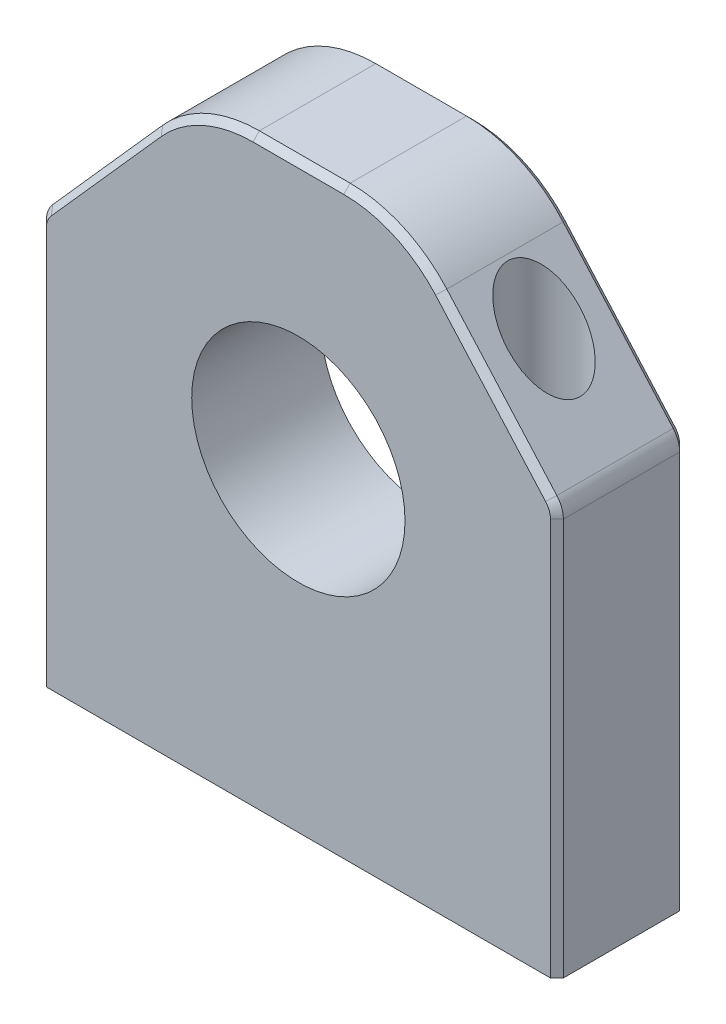
ISO-10303-21;
HEADER;
FILE_DESCRIPTION(('STEP AP214'),'2;1');
FILE_NAME('part.step','',(''),(''),'','','');
FILE_SCHEMA(('AUTOMOTIVE_DESIGN { 1 0 10303 214 1 1 1 1 }'));
ENDSEC;
DATA;
#1=APPLICATION_CONTEXT('core data for automotive mechanical design processes');
#2=APPLICATION_PROTOCOL_DEFINITION('international standard','automotive_design',2000,#1);
#3=PRODUCT_CONTEXT('',#1,'mechanical');
#4=PRODUCT('Part','Part','',(#3));
#5=PRODUCT_RELATED_PRODUCT_CATEGORY('part','',(#4));
#6=PRODUCT_DEFINITION_FORMATION('','',#4);
#7=PRODUCT_DEFINITION_CONTEXT('part definition',#1,'design');
#8=PRODUCT_DEFINITION('design','',#6,#7);
#9=PRODUCT_DEFINITION_SHAPE('','',#8);
#10=(LENGTH_UNIT() NAMED_UNIT(*) SI_UNIT(.MILLI.,.METRE.));
#11=(NAMED_UNIT(*) PLANE_ANGLE_UNIT() SI_UNIT($,.RADIAN.));
#12=(NAMED_UNIT(*) SI_UNIT($,.STERADIAN.) SOLID_ANGLE_UNIT());
#13=UNCERTAINTY_MEASURE_WITH_UNIT(LENGTH_MEASURE(1.E-05),#10,'distance_accuracy_value','');
#14=(GEOMETRIC_REPRESENTATION_CONTEXT(3) GLOBAL_UNCERTAINTY_ASSIGNED_CONTEXT((#13)) GLOBAL_UNIT_ASSIGNED_CONTEXT((#10,
#11,#12)) REPRESENTATION_CONTEXT('',''));
#15=CARTESIAN_POINT('',(0.,0.,0.));
#16=DIRECTION('',(0.,0.,1.));
#17=DIRECTION('',(1.,0.,0.));
#18=AXIS2_PLACEMENT_3D('',#15,#16,#17);
#19=CARTESIAN_POINT('',(14.,45.,5.));
#20=DIRECTION('',(0.,1.,0.));
#21=DIRECTION('',(0.,0.,1.));
#22=AXIS2_PLACEMENT_3D('',#19,#20,#21);
#23=CYLINDRICAL_SURFACE('',#22,1.69999999999999);
#24=CARTESIAN_POINT('',(14.,0.,5.));
#25=DIRECTION('',(0.,1.,0.));
#26=DIRECTION('',(0.,0.,1.));
#27=AXIS2_PLACEMENT_3D('',#24,#25,#26);
#28=CIRCLE('',#27,1.69999999999999);
#29=CARTESIAN_POINT('',(14.,0.,6.69999999999999));
#30=VERTEX_POINT('',#29);
#31=EDGE_CURVE('E220',#30,#30,#28,.F.);
#32=ORIENTED_EDGE('',*,*,#31,.T.);
#33=EDGE_LOOP('',(#32));
#34=FACE_BOUND('',#33,.T.);
#35=CARTESIAN_POINT('',(14.,10.,5.));
#36=DIRECTION('',(0.,1.,0.));
#37=DIRECTION('',(0.,0.,1.));
#38=AXIS2_PLACEMENT_3D('',#35,#36,#37);
#39=CIRCLE('',#38,1.69999999999999);
#40=CARTESIAN_POINT('',(14.,10.,6.69999999999999));
#41=VERTEX_POINT('',#40);
#42=EDGE_CURVE('E228',#41,#41,#39,.F.);
#43=ORIENTED_EDGE('',*,*,#42,.F.);
#44=EDGE_LOOP('',(#43));
#45=FACE_BOUND('',#44,.T.);
#46=ADVANCED_FACE('F43',(#34,#45),#23,.F.);
#47=CARTESIAN_POINT('',(-14.,45.,5.));
#48=DIRECTION('',(0.,1.,0.));
#49=DIRECTION('',(0.,0.,1.));
#50=AXIS2_PLACEMENT_3D('',#47,#48,#49);
#51=CYLINDRICAL_SURFACE('',#50,1.69999999999999);
#52=CARTESIAN_POINT('',(-14.,0.,5.));
#53=DIRECTION('',(0.,1.,0.));
#54=DIRECTION('',(0.,0.,1.));
#55=AXIS2_PLACEMENT_3D('',#52,#53,#54);
#56=CIRCLE('',#55,1.69999999999999);
#57=CARTESIAN_POINT('',(-14.,0.,6.69999999999999));
#58=VERTEX_POINT('',#57);
#59=EDGE_CURVE('E238',#58,#58,#56,.F.);
#60=ORIENTED_EDGE('',*,*,#59,.T.);
#61=EDGE_LOOP('',(#60));
#62=FACE_BOUND('',#61,.T.);
#63=CARTESIAN_POINT('',(-14.,10.,5.));
#64=DIRECTION('',(0.,1.,0.));
#65=DIRECTION('',(0.,0.,1.));
#66=AXIS2_PLACEMENT_3D('',#63,#64,#65);
#67=CIRCLE('',#66,1.69999999999999);
#68=CARTESIAN_POINT('',(-14.,10.,6.69999999999999));
#69=VERTEX_POINT('',#68);
#70=EDGE_CURVE('E225',#69,#69,#67,.F.);
#71=ORIENTED_EDGE('',*,*,#70,.F.);
#72=EDGE_LOOP('',(#71));
#73=FACE_BOUND('',#72,.T.);
#74=ADVANCED_FACE('F473',(#62,#73),#51,.F.);
#75=CARTESIAN_POINT('',(0.,0.,10.));
#76=DIRECTION('',(0.,1.,0.));
#77=DIRECTION('',(0.,0.,1.));
#78=AXIS2_PLACEMENT_3D('',#75,#76,#77);
#79=PLANE('',#78);
#80=DIRECTION('',(1.,0.,0.));
#81=VECTOR('',#80,1.);
#82=CARTESIAN_POINT('',(0.,0.,10.));
#83=LINE('',#82,#81);
#84=CARTESIAN_POINT('',(-19.5,0.,10.));
#85=VERTEX_POINT('',#84);
#86=CARTESIAN_POINT('',(19.5,0.,10.));
#87=VERTEX_POINT('',#86);
#88=EDGE_CURVE('E195',#85,#87,#83,.T.);
#89=ORIENTED_EDGE('',*,*,#88,.F.);
#90=DIRECTION('',(-0.707106781186543,0.,-0.707106781186552));
#91=VECTOR('',#90,1.);
#92=CARTESIAN_POINT('',(-19.5,0.,10.));
#93=LINE('',#92,#91);
#94=CARTESIAN_POINT('',(-20.,0.,9.49999999999999));
#95=VERTEX_POINT('',#94);
#96=EDGE_CURVE('E179',#85,#95,#93,.T.);
#97=ORIENTED_EDGE('',*,*,#96,.T.);
#98=DIRECTION('',(0.,0.,-1.));
#99=VECTOR('',#98,1.);
#100=CARTESIAN_POINT('',(-20.,0.,10.));
#101=LINE('',#100,#99);
#102=CARTESIAN_POINT('',(-20.,0.,0.499999999999973));
#103=VERTEX_POINT('',#102);
#104=EDGE_CURVE('E210',#95,#103,#101,.T.);
#105=ORIENTED_EDGE('',*,*,#104,.T.);
#106=DIRECTION('',(-0.707106781186548,0.,0.707106781186548));
#107=VECTOR('',#106,1.);
#108=CARTESIAN_POINT('',(-20.,0.,0.499999999999973));
#109=LINE('',#108,#107);
#110=CARTESIAN_POINT('',(-19.5,0.,0.));
#111=VERTEX_POINT('',#110);
#112=EDGE_CURVE('E278',#103,#111,#109,.F.);
#113=ORIENTED_EDGE('',*,*,#112,.T.);
#114=DIRECTION('',(1.,0.,0.));
#115=VECTOR('',#114,1.);
#116=CARTESIAN_POINT('',(0.,0.,0.));
#117=LINE('',#116,#115);
#118=CARTESIAN_POINT('',(19.5,0.,0.));
#119=VERTEX_POINT('',#118);
#120=EDGE_CURVE('E213',#111,#119,#117,.T.);
#121=ORIENTED_EDGE('',*,*,#120,.T.);
#122=DIRECTION('',(0.707106781186548,0.,0.707106781186548));
#123=VECTOR('',#122,1.);
#124=CARTESIAN_POINT('',(19.5,0.,0.));
#125=LINE('',#124,#123);
#126=CARTESIAN_POINT('',(20.,0.,0.499999999999973));
#127=VERTEX_POINT('',#126);
#128=EDGE_CURVE('E200',#119,#127,#125,.T.);
#129=ORIENTED_EDGE('',*,*,#128,.T.);
#130=DIRECTION('',(0.,0.,-1.));
#131=VECTOR('',#130,1.);
#132=CARTESIAN_POINT('',(20.,0.,10.));
#133=LINE('',#132,#131);
#134=CARTESIAN_POINT('',(20.,0.,9.49999999999999));
#135=VERTEX_POINT('',#134);
#136=EDGE_CURVE('E206',#135,#127,#133,.T.);
#137=ORIENTED_EDGE('',*,*,#136,.F.);
#138=DIRECTION('',(0.707106781186543,0.,-0.707106781186552));
#139=VECTOR('',#138,1.);
#140=CARTESIAN_POINT('',(20.,0.,9.49999999999999));
#141=LINE('',#140,#139);
#142=EDGE_CURVE('E190',#135,#87,#141,.F.);
#143=ORIENTED_EDGE('',*,*,#142,.T.);
#144=EDGE_LOOP('',(#89,#97,#105,#113,#121,#129,#137,#143));
#145=FACE_BOUND('',#144,.T.);
#146=ORIENTED_EDGE('',*,*,#31,.F.);
#147=EDGE_LOOP('',(#146));
#148=FACE_BOUND('',#147,.T.);
#149=ORIENTED_EDGE('',*,*,#59,.F.);
#150=EDGE_LOOP('',(#149));
#151=FACE_BOUND('',#150,.T.);
#152=ADVANCED_FACE('F202',(#145,#148,#151),#79,.F.);
#153=CARTESIAN_POINT('',(-20.,0.,10.));
#154=DIRECTION('',(1.,0.,0.));
#155=DIRECTION('',(0.,1.,0.));
#156=AXIS2_PLACEMENT_3D('',#153,#154,#155);
#157=PLANE('',#156);
#158=ORIENTED_EDGE('',*,*,#104,.F.);
#159=DIRECTION('',(0.,1.,0.));
#160=VECTOR('',#159,1.);
#161=CARTESIAN_POINT('',(-20.,30.7396013553019,9.49999999999999));
#162=LINE('',#161,#160);
#163=CARTESIAN_POINT('',(-20.,30.7396013553019,9.49999999999999));
#164=VERTEX_POINT('',#163);
#165=EDGE_CURVE('E184',#95,#164,#162,.T.);
#166=ORIENTED_EDGE('',*,*,#165,.T.);
#167=DIRECTION('',(0.,0.,-1.));
#168=VECTOR('',#167,1.);
#169=CARTESIAN_POINT('',(-20.,30.7396013553019,10.));
#170=LINE('',#169,#168);
#171=CARTESIAN_POINT('',(-20.,30.7396013553019,0.499999999999973));
#172=VERTEX_POINT('',#171);
#173=EDGE_CURVE('E250',#164,#172,#170,.T.);
#174=ORIENTED_EDGE('',*,*,#173,.T.);
#175=DIRECTION('',(0.,-1.,0.));
#176=VECTOR('',#175,1.);
#177=CARTESIAN_POINT('',(-20.,0.,0.499999999999973));
#178=LINE('',#177,#176);
#179=EDGE_CURVE('E189',#172,#103,#178,.T.);
#180=ORIENTED_EDGE('',*,*,#179,.T.);
#181=EDGE_LOOP('',(#158,#166,#174,#180));
#182=FACE_BOUND('',#181,.T.);
#183=ADVANCED_FACE('F394',(#182),#157,.F.);
#184=CARTESIAN_POINT('',(20.,0.,10.));
#185=DIRECTION('',(1.,0.,0.));
#186=DIRECTION('',(0.,1.,0.));
#187=AXIS2_PLACEMENT_3D('',#184,#185,#186);
#188=PLANE('',#187);
#189=DIRECTION('',(0.,0.,-1.));
#190=VECTOR('',#189,1.);
#191=CARTESIAN_POINT('',(20.,30.7396013553019,10.));
#192=LINE('',#191,#190);
#193=CARTESIAN_POINT('',(20.,30.7396013553019,0.499999999999973));
#194=VERTEX_POINT('',#193);
#195=CARTESIAN_POINT('',(20.,30.7396013553019,9.49999999999999));
#196=VERTEX_POINT('',#195);
#197=EDGE_CURVE('E259',#194,#196,#192,.F.);
#198=ORIENTED_EDGE('',*,*,#197,.T.);
#199=DIRECTION('',(0.,-1.,0.));
#200=VECTOR('',#199,1.);
#201=CARTESIAN_POINT('',(20.,0.,9.49999999999999));
#202=LINE('',#201,#200);
#203=EDGE_CURVE('E302',#196,#135,#202,.T.);
#204=ORIENTED_EDGE('',*,*,#203,.T.);
#205=ORIENTED_EDGE('',*,*,#136,.T.);
#206=DIRECTION('',(0.,1.,0.));
#207=VECTOR('',#206,1.);
#208=CARTESIAN_POINT('',(20.,30.7396013553019,0.499999999999973));
#209=LINE('',#208,#207);
#210=EDGE_CURVE('E300',#127,#194,#209,.T.);
#211=ORIENTED_EDGE('',*,*,#210,.T.);
#212=EDGE_LOOP('',(#198,#204,#205,#211));
#213=FACE_BOUND('',#212,.T.);
#214=ADVANCED_FACE('F460',(#213),#188,.T.);
#215=CARTESIAN_POINT('',(26.8137931034483,23.8344827586207,10.));
#216=DIRECTION('',(0.74740931868366,0.66436383882992,0.));
#217=DIRECTION('',(-0.66436383882992,0.74740931868366,0.));
#218=AXIS2_PLACEMENT_3D('',#215,#216,#217);
#219=PLANE('',#218);
#220=CARTESIAN_POINT('',(14.,38.25,5.));
#221=DIRECTION('',(0.74740931868366,0.66436383882992,0.));
#222=DIRECTION('',(-0.66436383882992,0.74740931868366,0.));
#223=AXIS2_PLACEMENT_3D('',#220,#221,#222);
#224=ELLIPSE('',#223,4.2145581025773,2.8);
#225=CARTESIAN_POINT('',(11.2,41.4,5.));
#226=VERTEX_POINT('',#225);
#227=EDGE_CURVE('E235',#226,#226,#224,.T.);
#228=ORIENTED_EDGE('',*,*,#227,.F.);
#229=EDGE_LOOP('',(#228));
#230=FACE_BOUND('',#229,.T.);
#231=DIRECTION('',(0.,0.,-1.));
#232=VECTOR('',#231,1.);
#233=CARTESIAN_POINT('',(10.9834325437341,41.6436383882992,10.));
#234=LINE('',#233,#232);
#235=CARTESIAN_POINT('',(10.9834325437341,41.6436383882992,0.499999999999973));
#236=VERTEX_POINT('',#235);
#237=CARTESIAN_POINT('',(10.9834325437341,41.6436383882992,9.49999999999999));
#238=VERTEX_POINT('',#237);
#239=EDGE_CURVE('E247',#236,#238,#234,.F.);
#240=ORIENTED_EDGE('',*,*,#239,.T.);
#241=DIRECTION('',(0.66436383882992,-0.74740931868366,0.));
#242=VECTOR('',#241,1.);
#243=CARTESIAN_POINT('',(26.8137931034483,23.8344827586207,9.49999999999999));
#244=LINE('',#243,#242);
#245=CARTESIAN_POINT('',(19.4948186373673,32.0683290329618,9.49999999999999));
#246=VERTEX_POINT('',#245);
#247=EDGE_CURVE('E314',#238,#246,#244,.T.);
#248=ORIENTED_EDGE('',*,*,#247,.T.);
#249=DIRECTION('',(0.,0.,-1.));
#250=VECTOR('',#249,1.);
#251=CARTESIAN_POINT('',(19.4948186373673,32.0683290329618,10.));
#252=LINE('',#251,#250);
#253=CARTESIAN_POINT('',(19.4948186373673,32.0683290329618,0.499999999999974));
#254=VERTEX_POINT('',#253);
#255=EDGE_CURVE('E256',#246,#254,#252,.T.);
#256=ORIENTED_EDGE('',*,*,#255,.T.);
#257=DIRECTION('',(-0.66436383882992,0.74740931868366,0.));
#258=VECTOR('',#257,1.);
#259=CARTESIAN_POINT('',(10.9834325437341,41.6436383882992,0.499999999999974));
#260=LINE('',#259,#258);
#261=EDGE_CURVE('E312',#254,#236,#260,.T.);
#262=ORIENTED_EDGE('',*,*,#261,.T.);
#263=EDGE_LOOP('',(#240,#248,#256,#262));
#264=FACE_BOUND('',#263,.T.);
#265=ADVANCED_FACE('F425',(#230,#264),#219,.T.);
#266=CARTESIAN_POINT('',(0.,45.,10.));
#267=DIRECTION('',(0.,-1.,0.));
#268=DIRECTION('',(0.,0.,-1.));
#269=AXIS2_PLACEMENT_3D('',#266,#267,#268);
#270=PLANE('',#269);
#271=DIRECTION('',(0.,0.,-1.));
#272=VECTOR('',#271,1.);
#273=CARTESIAN_POINT('',(-3.50933935689746,45.,10.));
#274=LINE('',#273,#272);
#275=CARTESIAN_POINT('',(-3.50933935689746,45.,0.499999999999973));
#276=VERTEX_POINT('',#275);
#277=CARTESIAN_POINT('',(-3.50933935689746,45.,9.49999999999999));
#278=VERTEX_POINT('',#277);
#279=EDGE_CURVE('E244',#276,#278,#274,.F.);
#280=ORIENTED_EDGE('',*,*,#279,.T.);
#281=DIRECTION('',(1.,0.,0.));
#282=VECTOR('',#281,1.);
#283=CARTESIAN_POINT('',(3.50933935689746,45.,9.49999999999999));
#284=LINE('',#283,#282);
#285=CARTESIAN_POINT('',(3.50933935689746,45.,9.49999999999999));
#286=VERTEX_POINT('',#285);
#287=EDGE_CURVE('E298',#278,#286,#284,.T.);
#288=ORIENTED_EDGE('',*,*,#287,.T.);
#289=DIRECTION('',(0.,0.,-1.));
#290=VECTOR('',#289,1.);
#291=CARTESIAN_POINT('',(3.50933935689746,45.,0.));
#292=LINE('',#291,#290);
#293=CARTESIAN_POINT('',(3.50933935689746,45.,0.499999999999973));
#294=VERTEX_POINT('',#293);
#295=EDGE_CURVE('E241',#286,#294,#292,.T.);
#296=ORIENTED_EDGE('',*,*,#295,.T.);
#297=DIRECTION('',(-1.,0.,0.));
#298=VECTOR('',#297,1.);
#299=CARTESIAN_POINT('',(0.,45.,0.499999999999973));
#300=LINE('',#299,#298);
#301=EDGE_CURVE('E296',#294,#276,#300,.T.);
#302=ORIENTED_EDGE('',*,*,#301,.T.);
#303=EDGE_LOOP('',(#280,#288,#296,#302));
#304=FACE_BOUND('',#303,.T.);
#305=ADVANCED_FACE('F467',(#304),#270,.F.);
#306=CARTESIAN_POINT('',(0.,25.,10.));
#307=DIRECTION('',(0.,0.,-1.));
#308=DIRECTION('',(-1.,0.,0.));
#309=AXIS2_PLACEMENT_3D('',#306,#307,#308);
#310=CYLINDRICAL_SURFACE('',#309,8.25);
#311=CARTESIAN_POINT('',(0.,25.,10.));
#312=DIRECTION('',(0.,0.,1.));
#313=DIRECTION('',(1.,0.,0.));
#314=AXIS2_PLACEMENT_3D('',#311,#312,#313);
#315=CIRCLE('',#314,8.25);
#316=CARTESIAN_POINT('',(8.25,25.,10.));
#317=VERTEX_POINT('',#316);
#318=EDGE_CURVE('E207',#317,#317,#315,.T.);
#319=ORIENTED_EDGE('',*,*,#318,.T.);
#320=EDGE_LOOP('',(#319));
#321=FACE_BOUND('',#320,.T.);
#322=CARTESIAN_POINT('',(0.,25.,0.));
#323=DIRECTION('',(0.,0.,1.));
#324=DIRECTION('',(1.,0.,0.));
#325=AXIS2_PLACEMENT_3D('',#322,#323,#324);
#326=CIRCLE('',#325,8.25);
#327=CARTESIAN_POINT('',(8.25,25.,0.));
#328=VERTEX_POINT('',#327);
#329=EDGE_CURVE('E217',#328,#328,#326,.T.);
#330=ORIENTED_EDGE('',*,*,#329,.F.);
#331=EDGE_LOOP('',(#330));
#332=FACE_BOUND('',#331,.T.);
#333=ADVANCED_FACE('F494',(#321,#332),#310,.F.);
#334=CARTESIAN_POINT('',(-26.8137931034483,23.8344827586207,10.));
#335=DIRECTION('',(0.74740931868366,-0.66436383882992,0.));
#336=DIRECTION('',(0.66436383882992,0.74740931868366,0.));
#337=AXIS2_PLACEMENT_3D('',#334,#335,#336);
#338=PLANE('',#337);
#339=CARTESIAN_POINT('',(-14.,38.25,5.));
#340=DIRECTION('',(0.74740931868366,-0.66436383882992,0.));
#341=DIRECTION('',(0.66436383882992,0.74740931868366,0.));
#342=AXIS2_PLACEMENT_3D('',#339,#340,#341);
#343=ELLIPSE('',#342,4.2145581025773,2.8);
#344=CARTESIAN_POINT('',(-11.2,41.4,5.));
#345=VERTEX_POINT('',#344);
#346=EDGE_CURVE('E232',#345,#345,#343,.T.);
#347=ORIENTED_EDGE('',*,*,#346,.T.);
#348=EDGE_LOOP('',(#347));
#349=FACE_BOUND('',#348,.T.);
#350=DIRECTION('',(0.,0.,-1.));
#351=VECTOR('',#350,1.);
#352=CARTESIAN_POINT('',(-19.4948186373673,32.0683290329618,10.));
#353=LINE('',#352,#351);
#354=CARTESIAN_POINT('',(-19.4948186373673,32.0683290329618,0.499999999999974));
#355=VERTEX_POINT('',#354);
#356=CARTESIAN_POINT('',(-19.4948186373673,32.0683290329618,9.49999999999999));
#357=VERTEX_POINT('',#356);
#358=EDGE_CURVE('E253',#355,#357,#353,.F.);
#359=ORIENTED_EDGE('',*,*,#358,.T.);
#360=DIRECTION('',(0.66436383882992,0.74740931868366,0.));
#361=VECTOR('',#360,1.);
#362=CARTESIAN_POINT('',(-10.9834325437341,41.6436383882992,9.49999999999999));
#363=LINE('',#362,#361);
#364=CARTESIAN_POINT('',(-10.9834325437341,41.6436383882992,9.49999999999999));
#365=VERTEX_POINT('',#364);
#366=EDGE_CURVE('E290',#357,#365,#363,.T.);
#367=ORIENTED_EDGE('',*,*,#366,.T.);
#368=DIRECTION('',(0.,0.,-1.));
#369=VECTOR('',#368,1.);
#370=CARTESIAN_POINT('',(-10.9834325437341,41.6436383882992,10.));
#371=LINE('',#370,#369);
#372=CARTESIAN_POINT('',(-10.9834325437341,41.6436383882992,0.499999999999973));
#373=VERTEX_POINT('',#372);
#374=EDGE_CURVE('E224',#365,#373,#371,.T.);
#375=ORIENTED_EDGE('',*,*,#374,.T.);
#376=DIRECTION('',(-0.66436383882992,-0.74740931868366,0.));
#377=VECTOR('',#376,1.);
#378=CARTESIAN_POINT('',(-26.8137931034483,23.8344827586207,0.499999999999974));
#379=LINE('',#378,#377);
#380=EDGE_CURVE('E288',#373,#355,#379,.T.);
#381=ORIENTED_EDGE('',*,*,#380,.T.);
#382=EDGE_LOOP('',(#359,#367,#375,#381));
#383=FACE_BOUND('',#382,.T.);
#384=ADVANCED_FACE('F487',(#349,#383),#338,.F.);
#385=CARTESIAN_POINT('',(0.,0.,10.));
#386=DIRECTION('',(0.,0.,1.));
#387=DIRECTION('',(1.,0.,0.));
#388=AXIS2_PLACEMENT_3D('',#385,#386,#387);
#389=PLANE('',#388);
#390=ORIENTED_EDGE('',*,*,#318,.F.);
#391=EDGE_LOOP('',(#390));
#392=FACE_BOUND('',#391,.T.);
#393=CARTESIAN_POINT('',(-18.,30.7396013553019,10.));
#394=DIRECTION('',(0.,0.,1.));
#395=DIRECTION('',(1.,0.,0.));
#396=AXIS2_PLACEMENT_3D('',#393,#394,#395);
#397=CIRCLE('',#396,1.5);
#398=CARTESIAN_POINT('',(-19.1211139780255,31.7361471135468,10.));
#399=VERTEX_POINT('',#398);
#400=CARTESIAN_POINT('',(-19.5,30.7396013553019,10.));
#401=VERTEX_POINT('',#400);
#402=EDGE_CURVE('E198',#399,#401,#397,.T.);
#403=ORIENTED_EDGE('',*,*,#402,.T.);
#404=DIRECTION('',(0.,-1.,0.));
#405=VECTOR('',#404,1.);
#406=CARTESIAN_POINT('',(-19.5,0.,10.));
#407=LINE('',#406,#405);
#408=EDGE_CURVE('E183',#401,#85,#407,.T.);
#409=ORIENTED_EDGE('',*,*,#408,.T.);
#410=ORIENTED_EDGE('',*,*,#88,.T.);
#411=DIRECTION('',(0.,1.,0.));
#412=VECTOR('',#411,1.);
#413=CARTESIAN_POINT('',(19.5,0.,10.));
#414=LINE('',#413,#412);
#415=CARTESIAN_POINT('',(19.5,30.7396013553019,10.));
#416=VERTEX_POINT('',#415);
#417=EDGE_CURVE('E268',#87,#416,#414,.T.);
#418=ORIENTED_EDGE('',*,*,#417,.T.);
#419=CARTESIAN_POINT('',(18.,30.7396013553019,10.));
#420=DIRECTION('',(0.,0.,1.));
#421=DIRECTION('',(1.,0.,0.));
#422=AXIS2_PLACEMENT_3D('',#419,#420,#421);
#423=CIRCLE('',#422,1.5);
#424=CARTESIAN_POINT('',(19.1211139780255,31.7361471135468,10.));
#425=VERTEX_POINT('',#424);
#426=EDGE_CURVE('E264',#416,#425,#423,.T.);
#427=ORIENTED_EDGE('',*,*,#426,.T.);
#428=DIRECTION('',(-0.66436383882992,0.74740931868366,0.));
#429=VECTOR('',#428,1.);
#430=CARTESIAN_POINT('',(26.4400884441065,23.5023008392057,10.));
#431=LINE('',#430,#429);
#432=CARTESIAN_POINT('',(10.6097278843922,41.3114564688842,10.));
#433=VERTEX_POINT('',#432);
#434=EDGE_CURVE('E262',#425,#433,#431,.T.);
#435=ORIENTED_EDGE('',*,*,#434,.T.);
#436=CARTESIAN_POINT('',(3.50933935689746,35.,10.));
#437=DIRECTION('',(0.,0.,1.));
#438=DIRECTION('',(1.,0.,0.));
#439=AXIS2_PLACEMENT_3D('',#436,#437,#438);
#440=CIRCLE('',#439,9.5);
#441=CARTESIAN_POINT('',(3.50933935689746,44.5,10.));
#442=VERTEX_POINT('',#441);
#443=EDGE_CURVE('E266',#433,#442,#440,.T.);
#444=ORIENTED_EDGE('',*,*,#443,.T.);
#445=DIRECTION('',(-1.,0.,0.));
#446=VECTOR('',#445,1.);
#447=CARTESIAN_POINT('',(-3.50933935689746,44.5,10.));
#448=LINE('',#447,#446);
#449=CARTESIAN_POINT('',(-3.50933935689746,44.5,10.));
#450=VERTEX_POINT('',#449);
#451=EDGE_CURVE('E270',#442,#450,#448,.T.);
#452=ORIENTED_EDGE('',*,*,#451,.T.);
#453=CARTESIAN_POINT('',(-3.50933935689746,35.,10.));
#454=DIRECTION('',(0.,0.,1.));
#455=DIRECTION('',(1.,0.,0.));
#456=AXIS2_PLACEMENT_3D('',#453,#454,#455);
#457=CIRCLE('',#456,9.5);
#458=CARTESIAN_POINT('',(-10.6097278843922,41.3114564688842,10.));
#459=VERTEX_POINT('',#458);
#460=EDGE_CURVE('E272',#450,#459,#457,.T.);
#461=ORIENTED_EDGE('',*,*,#460,.T.);
#462=DIRECTION('',(-0.66436383882992,-0.74740931868366,0.));
#463=VECTOR('',#462,1.);
#464=CARTESIAN_POINT('',(-19.1211139780255,31.7361471135468,10.));
#465=LINE('',#464,#463);
#466=EDGE_CURVE('E274',#459,#399,#465,.T.);
#467=ORIENTED_EDGE('',*,*,#466,.T.);
#468=EDGE_LOOP('',(#403,#409,#410,#418,#427,#435,#444,#452,#461,#467));
#469=FACE_BOUND('',#468,.T.);
#470=ADVANCED_FACE('F194',(#392,#469),#389,.T.);
#471=CARTESIAN_POINT('',(0.,0.,0.));
#472=DIRECTION('',(0.,0.,1.));
#473=DIRECTION('',(1.,0.,0.));
#474=AXIS2_PLACEMENT_3D('',#471,#472,#473);
#475=PLANE('',#474);
#476=ORIENTED_EDGE('',*,*,#120,.F.);
#477=DIRECTION('',(0.,1.,0.));
#478=VECTOR('',#477,1.);
#479=CARTESIAN_POINT('',(-19.5,0.,0.));
#480=LINE('',#479,#478);
#481=CARTESIAN_POINT('',(-19.5,30.7396013553019,0.));
#482=VERTEX_POINT('',#481);
#483=EDGE_CURVE('E12',#111,#482,#480,.T.);
#484=ORIENTED_EDGE('',*,*,#483,.T.);
#485=CARTESIAN_POINT('',(-18.,30.7396013553019,0.));
#486=DIRECTION('',(0.,0.,1.));
#487=DIRECTION('',(1.,0.,0.));
#488=AXIS2_PLACEMENT_3D('',#485,#486,#487);
#489=CIRCLE('',#488,1.50000000000003);
#490=CARTESIAN_POINT('',(-19.1211139780255,31.7361471135468,0.));
#491=VERTEX_POINT('',#490);
#492=EDGE_CURVE('E53',#482,#491,#489,.F.);
#493=ORIENTED_EDGE('',*,*,#492,.T.);
#494=DIRECTION('',(0.66436383882992,0.74740931868366,0.));
#495=VECTOR('',#494,1.);
#496=CARTESIAN_POINT('',(-26.4400884441065,23.5023008392058,0.));
#497=LINE('',#496,#495);
#498=CARTESIAN_POINT('',(-10.6097278843922,41.3114564688843,0.));
#499=VERTEX_POINT('',#498);
#500=EDGE_CURVE('E328',#491,#499,#497,.T.);
#501=ORIENTED_EDGE('',*,*,#500,.T.);
#502=CARTESIAN_POINT('',(-3.50933935689746,35.,0.));
#503=DIRECTION('',(0.,0.,1.));
#504=DIRECTION('',(1.,0.,0.));
#505=AXIS2_PLACEMENT_3D('',#502,#503,#504);
#506=CIRCLE('',#505,9.50000000000003);
#507=CARTESIAN_POINT('',(-3.50933935689746,44.5,0.));
#508=VERTEX_POINT('',#507);
#509=EDGE_CURVE('E324',#499,#508,#506,.F.);
#510=ORIENTED_EDGE('',*,*,#509,.T.);
#511=DIRECTION('',(1.,0.,0.));
#512=VECTOR('',#511,1.);
#513=CARTESIAN_POINT('',(0.,44.5,0.));
#514=LINE('',#513,#512);
#515=CARTESIAN_POINT('',(3.50933935689746,44.5,0.));
#516=VERTEX_POINT('',#515);
#517=EDGE_CURVE('E320',#508,#516,#514,.T.);
#518=ORIENTED_EDGE('',*,*,#517,.T.);
#519=CARTESIAN_POINT('',(3.50933935689746,35.,0.));
#520=DIRECTION('',(0.,0.,1.));
#521=DIRECTION('',(1.,0.,0.));
#522=AXIS2_PLACEMENT_3D('',#519,#520,#521);
#523=CIRCLE('',#522,9.50000000000003);
#524=CARTESIAN_POINT('',(10.6097278843922,41.3114564688843,0.));
#525=VERTEX_POINT('',#524);
#526=EDGE_CURVE('E316',#516,#525,#523,.F.);
#527=ORIENTED_EDGE('',*,*,#526,.T.);
#528=DIRECTION('',(0.66436383882992,-0.74740931868366,0.));
#529=VECTOR('',#528,1.);
#530=CARTESIAN_POINT('',(19.1211139780255,31.7361471135468,0.));
#531=LINE('',#530,#529);
#532=CARTESIAN_POINT('',(19.1211139780255,31.7361471135468,0.));
#533=VERTEX_POINT('',#532);
#534=EDGE_CURVE('E318',#525,#533,#531,.T.);
#535=ORIENTED_EDGE('',*,*,#534,.T.);
#536=CARTESIAN_POINT('',(18.,30.7396013553019,0.));
#537=DIRECTION('',(0.,0.,1.));
#538=DIRECTION('',(1.,0.,0.));
#539=AXIS2_PLACEMENT_3D('',#536,#537,#538);
#540=CIRCLE('',#539,1.50000000000003);
#541=CARTESIAN_POINT('',(19.5,30.7396013553019,0.));
#542=VERTEX_POINT('',#541);
#543=EDGE_CURVE('E322',#533,#542,#540,.F.);
#544=ORIENTED_EDGE('',*,*,#543,.T.);
#545=DIRECTION('',(0.,-1.,0.));
#546=VECTOR('',#545,1.);
#547=CARTESIAN_POINT('',(19.5,0.,0.));
#548=LINE('',#547,#546);
#549=EDGE_CURVE('E326',#542,#119,#548,.T.);
#550=ORIENTED_EDGE('',*,*,#549,.T.);
#551=EDGE_LOOP('',(#476,#484,#493,#501,#510,#518,#527,#535,#544,#550));
#552=FACE_BOUND('',#551,.T.);
#553=ORIENTED_EDGE('',*,*,#329,.T.);
#554=EDGE_LOOP('',(#553));
#555=FACE_BOUND('',#554,.T.);
#556=ADVANCED_FACE('F388',(#552,#555),#475,.F.);
#557=CARTESIAN_POINT('',(-14.,-7.91959594928933,5.));
#558=DIRECTION('',(0.,1.,0.));
#559=DIRECTION('',(0.,0.,1.));
#560=AXIS2_PLACEMENT_3D('',#557,#558,#559);
#561=CYLINDRICAL_SURFACE('',#560,2.8);
#562=CARTESIAN_POINT('',(-14.,10.,5.));
#563=DIRECTION('',(0.,1.,0.));
#564=DIRECTION('',(0.,0.,1.));
#565=AXIS2_PLACEMENT_3D('',#562,#563,#564);
#566=CIRCLE('',#565,2.8);
#567=CARTESIAN_POINT('',(-14.,10.,7.8));
#568=VERTEX_POINT('',#567);
#569=EDGE_CURVE('E354',#568,#568,#566,.F.);
#570=ORIENTED_EDGE('',*,*,#569,.T.);
#571=EDGE_LOOP('',(#570));
#572=FACE_BOUND('',#571,.T.);
#573=ORIENTED_EDGE('',*,*,#346,.F.);
#574=EDGE_LOOP('',(#573));
#575=FACE_BOUND('',#574,.T.);
#576=ADVANCED_FACE('F491',(#572,#575),#561,.F.);
#577=CARTESIAN_POINT('',(0.,10.,10.));
#578=DIRECTION('',(0.,1.,0.));
#579=DIRECTION('',(0.,0.,1.));
#580=AXIS2_PLACEMENT_3D('',#577,#578,#579);
#581=PLANE('',#580);
#582=ORIENTED_EDGE('',*,*,#569,.F.);
#583=EDGE_LOOP('',(#582));
#584=FACE_BOUND('',#583,.T.);
#585=ORIENTED_EDGE('',*,*,#70,.T.);
#586=EDGE_LOOP('',(#585));
#587=FACE_BOUND('',#586,.T.);
#588=ADVANCED_FACE('F745',(#584,#587),#581,.T.);
#589=CARTESIAN_POINT('',(0.,10.,10.));
#590=DIRECTION('',(0.,1.,0.));
#591=DIRECTION('',(0.,0.,1.));
#592=AXIS2_PLACEMENT_3D('',#589,#590,#591);
#593=PLANE('',#592);
#594=CARTESIAN_POINT('',(14.,10.,5.));
#595=DIRECTION('',(0.,1.,0.));
#596=DIRECTION('',(0.,0.,1.));
#597=AXIS2_PLACEMENT_3D('',#594,#595,#596);
#598=CIRCLE('',#597,2.8);
#599=CARTESIAN_POINT('',(14.,10.,7.8));
#600=VERTEX_POINT('',#599);
#601=EDGE_CURVE('E229',#600,#600,#598,.F.);
#602=ORIENTED_EDGE('',*,*,#601,.F.);
#603=EDGE_LOOP('',(#602));
#604=FACE_BOUND('',#603,.T.);
#605=ORIENTED_EDGE('',*,*,#42,.T.);
#606=EDGE_LOOP('',(#605));
#607=FACE_BOUND('',#606,.T.);
#608=ADVANCED_FACE('F735',(#604,#607),#593,.T.);
#609=CARTESIAN_POINT('',(14.,-7.91959594928933,5.));
#610=DIRECTION('',(0.,1.,0.));
#611=DIRECTION('',(0.,0.,1.));
#612=AXIS2_PLACEMENT_3D('',#609,#610,#611);
#613=CYLINDRICAL_SURFACE('',#612,2.8);
#614=ORIENTED_EDGE('',*,*,#227,.T.);
#615=EDGE_LOOP('',(#614));
#616=FACE_BOUND('',#615,.T.);
#617=ORIENTED_EDGE('',*,*,#601,.T.);
#618=EDGE_LOOP('',(#617));
#619=FACE_BOUND('',#618,.T.);
#620=ADVANCED_FACE('F677',(#616,#619),#613,.F.);
#621=CARTESIAN_POINT('',(-3.50933935689746,35.,10.));
#622=DIRECTION('',(0.,0.,-1.));
#623=DIRECTION('',(-1.,0.,0.));
#624=AXIS2_PLACEMENT_3D('',#621,#622,#623);
#625=CYLINDRICAL_SURFACE('',#624,10.);
#626=ORIENTED_EDGE('',*,*,#374,.F.);
#627=CARTESIAN_POINT('',(-3.50933935689746,35.,9.49999999999999));
#628=DIRECTION('',(0.,0.,1.));
#629=DIRECTION('',(1.,0.,0.));
#630=AXIS2_PLACEMENT_3D('',#627,#628,#629);
#631=CIRCLE('',#630,10.);
#632=EDGE_CURVE('E294',#365,#278,#631,.F.);
#633=ORIENTED_EDGE('',*,*,#632,.T.);
#634=ORIENTED_EDGE('',*,*,#279,.F.);
#635=CARTESIAN_POINT('',(-3.50933935689746,35.,0.499999999999973));
#636=DIRECTION('',(0.,0.,1.));
#637=DIRECTION('',(1.,0.,0.));
#638=AXIS2_PLACEMENT_3D('',#635,#636,#637);
#639=CIRCLE('',#638,10.);
#640=EDGE_CURVE('E292',#276,#373,#639,.T.);
#641=ORIENTED_EDGE('',*,*,#640,.T.);
#642=EDGE_LOOP('',(#626,#633,#634,#641));
#643=FACE_BOUND('',#642,.T.);
#644=ADVANCED_FACE('F506',(#643),#625,.T.);
#645=CARTESIAN_POINT('',(3.50933935689746,35.,10.));
#646=DIRECTION('',(0.,0.,1.));
#647=DIRECTION('',(1.,0.,0.));
#648=AXIS2_PLACEMENT_3D('',#645,#646,#647);
#649=CYLINDRICAL_SURFACE('',#648,10.);
#650=ORIENTED_EDGE('',*,*,#295,.F.);
#651=CARTESIAN_POINT('',(3.50933935689746,35.,9.49999999999999));
#652=DIRECTION('',(0.,0.,1.));
#653=DIRECTION('',(1.,0.,0.));
#654=AXIS2_PLACEMENT_3D('',#651,#652,#653);
#655=CIRCLE('',#654,10.);
#656=EDGE_CURVE('E306',#286,#238,#655,.F.);
#657=ORIENTED_EDGE('',*,*,#656,.T.);
#658=ORIENTED_EDGE('',*,*,#239,.F.);
#659=CARTESIAN_POINT('',(3.50933935689746,35.,0.499999999999973));
#660=DIRECTION('',(0.,0.,1.));
#661=DIRECTION('',(1.,0.,0.));
#662=AXIS2_PLACEMENT_3D('',#659,#660,#661);
#663=CIRCLE('',#662,10.);
#664=EDGE_CURVE('E304',#236,#294,#663,.T.);
#665=ORIENTED_EDGE('',*,*,#664,.T.);
#666=EDGE_LOOP('',(#650,#657,#658,#665));
#667=FACE_BOUND('',#666,.T.);
#668=ADVANCED_FACE('F430',(#667),#649,.T.);
#669=CARTESIAN_POINT('',(-18.,30.7396013553019,10.));
#670=DIRECTION('',(0.,0.,-1.));
#671=DIRECTION('',(-1.,0.,0.));
#672=AXIS2_PLACEMENT_3D('',#669,#670,#671);
#673=CYLINDRICAL_SURFACE('',#672,2.);
#674=ORIENTED_EDGE('',*,*,#173,.F.);
#675=CARTESIAN_POINT('',(-18.,30.7396013553019,9.49999999999999));
#676=DIRECTION('',(0.,0.,1.));
#677=DIRECTION('',(1.,0.,0.));
#678=AXIS2_PLACEMENT_3D('',#675,#676,#677);
#679=CIRCLE('',#678,2.);
#680=EDGE_CURVE('E286',#164,#357,#679,.F.);
#681=ORIENTED_EDGE('',*,*,#680,.T.);
#682=ORIENTED_EDGE('',*,*,#358,.F.);
#683=CARTESIAN_POINT('',(-18.,30.7396013553019,0.499999999999973));
#684=DIRECTION('',(0.,0.,1.));
#685=DIRECTION('',(1.,0.,0.));
#686=AXIS2_PLACEMENT_3D('',#683,#684,#685);
#687=CIRCLE('',#686,2.);
#688=EDGE_CURVE('E284',#355,#172,#687,.T.);
#689=ORIENTED_EDGE('',*,*,#688,.T.);
#690=EDGE_LOOP('',(#674,#681,#682,#689));
#691=FACE_BOUND('',#690,.T.);
#692=ADVANCED_FACE('F518',(#691),#673,.T.);
#693=CARTESIAN_POINT('',(18.,30.7396013553019,10.));
#694=DIRECTION('',(0.,0.,-1.));
#695=DIRECTION('',(-1.,0.,0.));
#696=AXIS2_PLACEMENT_3D('',#693,#694,#695);
#697=CYLINDRICAL_SURFACE('',#696,2.);
#698=ORIENTED_EDGE('',*,*,#255,.F.);
#699=CARTESIAN_POINT('',(18.,30.7396013553019,9.49999999999999));
#700=DIRECTION('',(0.,0.,1.));
#701=DIRECTION('',(1.,0.,0.));
#702=AXIS2_PLACEMENT_3D('',#699,#700,#701);
#703=CIRCLE('',#702,2.);
#704=EDGE_CURVE('E310',#246,#196,#703,.F.);
#705=ORIENTED_EDGE('',*,*,#704,.T.);
#706=ORIENTED_EDGE('',*,*,#197,.F.);
#707=CARTESIAN_POINT('',(18.,30.7396013553019,0.499999999999973));
#708=DIRECTION('',(0.,0.,1.));
#709=DIRECTION('',(1.,0.,0.));
#710=AXIS2_PLACEMENT_3D('',#707,#708,#709);
#711=CIRCLE('',#710,2.);
#712=EDGE_CURVE('E308',#194,#254,#711,.T.);
#713=ORIENTED_EDGE('',*,*,#712,.T.);
#714=EDGE_LOOP('',(#698,#705,#706,#713));
#715=FACE_BOUND('',#714,.T.);
#716=ADVANCED_FACE('F451',(#715),#697,.T.);
#717=CARTESIAN_POINT('',(20.,0.,9.49999999999999));
#718=DIRECTION('',(-0.707106781186552,0.,-0.707106781186542));
#719=DIRECTION('',(0.,-1.,0.));
#720=AXIS2_PLACEMENT_3D('',#717,#718,#719);
#721=PLANE('',#720);
#722=ORIENTED_EDGE('',*,*,#142,.F.);
#723=ORIENTED_EDGE('',*,*,#203,.F.);
#724=DIRECTION('',(0.707106781186542,0.,-0.707106781186552));
#725=VECTOR('',#724,1.);
#726=CARTESIAN_POINT('',(19.5,30.7396013553019,10.));
#727=LINE('',#726,#725);
#728=EDGE_CURVE('E351',#416,#196,#727,.T.);
#729=ORIENTED_EDGE('',*,*,#728,.F.);
#730=ORIENTED_EDGE('',*,*,#417,.F.);
#731=EDGE_LOOP('',(#722,#723,#729,#730));
#732=FACE_BOUND('',#731,.T.);
#733=ADVANCED_FACE('F458',(#732),#721,.F.);
#734=CARTESIAN_POINT('',(18.,30.7396013553019,10.));
#735=DIRECTION('',(0.,0.,-1.));
#736=DIRECTION('',(-1.,0.,0.));
#737=AXIS2_PLACEMENT_3D('',#734,#735,#736);
#738=CONICAL_SURFACE('',#737,1.5,0.785398163397443);
#739=ORIENTED_EDGE('',*,*,#728,.T.);
#740=ORIENTED_EDGE('',*,*,#704,.F.);
#741=DIRECTION('',(0.528498197563229,0.469776175611761,-0.707106781186552));
#742=VECTOR('',#741,1.);
#743=CARTESIAN_POINT('',(19.1211139780255,31.7361471135468,10.));
#744=LINE('',#743,#742);
#745=EDGE_CURVE('E348',#425,#246,#744,.T.);
#746=ORIENTED_EDGE('',*,*,#745,.F.);
#747=ORIENTED_EDGE('',*,*,#426,.F.);
#748=EDGE_LOOP('',(#739,#740,#746,#747));
#749=FACE_BOUND('',#748,.T.);
#750=ADVANCED_FACE('F454',(#749),#738,.T.);
#751=CARTESIAN_POINT('',(26.8137931034483,23.8344827586207,9.49999999999999));
#752=DIRECTION('',(-0.52849819756324,-0.469776175611769,-0.707106781186538));
#753=DIRECTION('',(0.66436383882992,-0.74740931868366,0.));
#754=AXIS2_PLACEMENT_3D('',#751,#752,#753);
#755=PLANE('',#754);
#756=ORIENTED_EDGE('',*,*,#745,.T.);
#757=ORIENTED_EDGE('',*,*,#247,.F.);
#758=DIRECTION('',(0.528498197563222,0.469776175611757,-0.70710678118656));
#759=VECTOR('',#758,1.);
#760=CARTESIAN_POINT('',(10.6097278843922,41.3114564688842,10.));
#761=LINE('',#760,#759);
#762=EDGE_CURVE('E345',#433,#238,#761,.T.);
#763=ORIENTED_EDGE('',*,*,#762,.F.);
#764=ORIENTED_EDGE('',*,*,#434,.F.);
#765=EDGE_LOOP('',(#756,#757,#763,#764));
#766=FACE_BOUND('',#765,.T.);
#767=ADVANCED_FACE('F448',(#766),#755,.F.);
#768=CARTESIAN_POINT('',(3.50933935689746,35.,10.));
#769=DIRECTION('',(0.,0.,-1.));
#770=DIRECTION('',(-1.,0.,0.));
#771=AXIS2_PLACEMENT_3D('',#768,#769,#770);
#772=CONICAL_SURFACE('',#771,9.5,0.785398163397443);
#773=ORIENTED_EDGE('',*,*,#762,.T.);
#774=ORIENTED_EDGE('',*,*,#656,.F.);
#775=DIRECTION('',(0.,0.707106781186542,-0.707106781186552));
#776=VECTOR('',#775,1.);
#777=CARTESIAN_POINT('',(3.50933935689746,44.5,10.));
#778=LINE('',#777,#776);
#779=EDGE_CURVE('E342',#442,#286,#778,.T.);
#780=ORIENTED_EDGE('',*,*,#779,.F.);
#781=ORIENTED_EDGE('',*,*,#443,.F.);
#782=EDGE_LOOP('',(#773,#774,#780,#781));
#783=FACE_BOUND('',#782,.T.);
#784=ADVANCED_FACE('F434',(#783),#772,.T.);
#785=CARTESIAN_POINT('',(0.,44.5,10.));
#786=DIRECTION('',(0.,0.707106781186552,0.707106781186542));
#787=DIRECTION('',(1.,0.,0.));
#788=AXIS2_PLACEMENT_3D('',#785,#786,#787);
#789=PLANE('',#788);
#790=ORIENTED_EDGE('',*,*,#779,.T.);
#791=ORIENTED_EDGE('',*,*,#287,.F.);
#792=DIRECTION('',(0.,0.707106781186542,-0.707106781186552));
#793=VECTOR('',#792,1.);
#794=CARTESIAN_POINT('',(-3.50933935689746,44.5,10.));
#795=LINE('',#794,#793);
#796=EDGE_CURVE('E339',#450,#278,#795,.T.);
#797=ORIENTED_EDGE('',*,*,#796,.F.);
#798=ORIENTED_EDGE('',*,*,#451,.F.);
#799=EDGE_LOOP('',(#790,#791,#797,#798));
#800=FACE_BOUND('',#799,.T.);
#801=ADVANCED_FACE('F440',(#800),#789,.T.);
#802=CARTESIAN_POINT('',(-3.50933935689746,35.,10.));
#803=DIRECTION('',(0.,0.,-1.));
#804=DIRECTION('',(-1.,0.,0.));
#805=AXIS2_PLACEMENT_3D('',#802,#803,#804);
#806=CONICAL_SURFACE('',#805,9.5,0.78539816339744);
#807=ORIENTED_EDGE('',*,*,#796,.T.);
#808=ORIENTED_EDGE('',*,*,#632,.F.);
#809=DIRECTION('',(-0.528498197563229,0.469776175611761,-0.707106781186552));
#810=VECTOR('',#809,1.);
#811=CARTESIAN_POINT('',(-10.6097278843922,41.3114564688842,10.));
#812=LINE('',#811,#810);
#813=EDGE_CURVE('E336',#459,#365,#812,.T.);
#814=ORIENTED_EDGE('',*,*,#813,.F.);
#815=ORIENTED_EDGE('',*,*,#460,.F.);
#816=EDGE_LOOP('',(#807,#808,#814,#815));
#817=FACE_BOUND('',#816,.T.);
#818=ADVANCED_FACE('F509',(#817),#806,.T.);
#819=CARTESIAN_POINT('',(-26.4400884441065,23.5023008392057,10.));
#820=DIRECTION('',(-0.52849819756324,0.469776175611769,0.707106781186538));
#821=DIRECTION('',(0.66436383882992,0.74740931868366,0.));
#822=AXIS2_PLACEMENT_3D('',#819,#820,#821);
#823=PLANE('',#822);
#824=ORIENTED_EDGE('',*,*,#813,.T.);
#825=ORIENTED_EDGE('',*,*,#366,.F.);
#826=DIRECTION('',(-0.528498197563224,0.469776175611756,-0.707106781186559));
#827=VECTOR('',#826,1.);
#828=CARTESIAN_POINT('',(-19.1211139780255,31.7361471135468,10.));
#829=LINE('',#828,#827);
#830=EDGE_CURVE('E333',#399,#357,#829,.T.);
#831=ORIENTED_EDGE('',*,*,#830,.F.);
#832=ORIENTED_EDGE('',*,*,#466,.F.);
#833=EDGE_LOOP('',(#824,#825,#831,#832));
#834=FACE_BOUND('',#833,.T.);
#835=ADVANCED_FACE('F513',(#834),#823,.T.);
#836=CARTESIAN_POINT('',(-18.,30.7396013553019,10.));
#837=DIRECTION('',(0.,0.,-1.));
#838=DIRECTION('',(-1.,0.,0.));
#839=AXIS2_PLACEMENT_3D('',#836,#837,#838);
#840=CONICAL_SURFACE('',#839,1.5,0.785398163397442);
#841=ORIENTED_EDGE('',*,*,#830,.T.);
#842=ORIENTED_EDGE('',*,*,#680,.F.);
#843=DIRECTION('',(-0.707106781186542,0.,-0.707106781186552));
#844=VECTOR('',#843,1.);
#845=CARTESIAN_POINT('',(-19.5,30.7396013553019,10.));
#846=LINE('',#845,#844);
#847=EDGE_CURVE('E331',#401,#164,#846,.T.);
#848=ORIENTED_EDGE('',*,*,#847,.F.);
#849=ORIENTED_EDGE('',*,*,#402,.F.);
#850=EDGE_LOOP('',(#841,#842,#848,#849));
#851=FACE_BOUND('',#850,.T.);
#852=ADVANCED_FACE('F516',(#851),#840,.T.);
#853=CARTESIAN_POINT('',(-19.5,0.,10.));
#854=DIRECTION('',(-0.707106781186552,0.,0.707106781186542));
#855=DIRECTION('',(0.,1.,0.));
#856=AXIS2_PLACEMENT_3D('',#853,#854,#855);
#857=PLANE('',#856);
#858=ORIENTED_EDGE('',*,*,#847,.T.);
#859=ORIENTED_EDGE('',*,*,#165,.F.);
#860=ORIENTED_EDGE('',*,*,#96,.F.);
#861=ORIENTED_EDGE('',*,*,#408,.F.);
#862=EDGE_LOOP('',(#858,#859,#860,#861));
#863=FACE_BOUND('',#862,.T.);
#864=ADVANCED_FACE('F182',(#863),#857,.T.);
#865=CARTESIAN_POINT('',(19.5,0.,0.));
#866=DIRECTION('',(0.707106781186547,0.,-0.707106781186547));
#867=DIRECTION('',(0.,1.,0.));
#868=AXIS2_PLACEMENT_3D('',#865,#866,#867);
#869=PLANE('',#868);
#870=ORIENTED_EDGE('',*,*,#128,.F.);
#871=ORIENTED_EDGE('',*,*,#549,.F.);
#872=DIRECTION('',(-0.707106781186547,0.,-0.707106781186548));
#873=VECTOR('',#872,1.);
#874=CARTESIAN_POINT('',(20.,30.7396013553019,0.499999999999973));
#875=LINE('',#874,#873);
#876=EDGE_CURVE('E48',#194,#542,#875,.T.);
#877=ORIENTED_EDGE('',*,*,#876,.F.);
#878=ORIENTED_EDGE('',*,*,#210,.F.);
#879=EDGE_LOOP('',(#870,#871,#877,#878));
#880=FACE_BOUND('',#879,.T.);
#881=ADVANCED_FACE('F46',(#880),#869,.T.);
#882=CARTESIAN_POINT('',(18.,30.7396013553019,0.));
#883=DIRECTION('',(0.,0.,1.));
#884=DIRECTION('',(1.,0.,0.));
#885=AXIS2_PLACEMENT_3D('',#882,#883,#884);
#886=CONICAL_SURFACE('',#885,1.50000000000003,0.78539816339745);
#887=ORIENTED_EDGE('',*,*,#876,.T.);
#888=ORIENTED_EDGE('',*,*,#543,.F.);
#889=DIRECTION('',(-0.528498197563233,-0.469776175611762,-0.707106781186548));
#890=VECTOR('',#889,1.);
#891=CARTESIAN_POINT('',(19.4948186373673,32.0683290329618,0.499999999999973));
#892=LINE('',#891,#890);
#893=EDGE_CURVE('E372',#254,#533,#892,.T.);
#894=ORIENTED_EDGE('',*,*,#893,.F.);
#895=ORIENTED_EDGE('',*,*,#712,.F.);
#896=EDGE_LOOP('',(#887,#888,#894,#895));
#897=FACE_BOUND('',#896,.T.);
#898=ADVANCED_FACE('F383',(#897),#886,.T.);
#899=CARTESIAN_POINT('',(26.4400884441065,23.5023008392058,0.));
#900=DIRECTION('',(0.528498197563236,0.469776175611766,-0.707106781186544));
#901=DIRECTION('',(-0.66436383882992,0.74740931868366,0.));
#902=AXIS2_PLACEMENT_3D('',#899,#900,#901);
#903=PLANE('',#902);
#904=ORIENTED_EDGE('',*,*,#893,.T.);
#905=ORIENTED_EDGE('',*,*,#534,.F.);
#906=DIRECTION('',(-0.528498197563229,-0.469776175611762,-0.707106781186551));
#907=VECTOR('',#906,1.);
#908=CARTESIAN_POINT('',(10.9834325437341,41.6436383882992,0.499999999999974));
#909=LINE('',#908,#907);
#910=EDGE_CURVE('E370',#236,#525,#909,.T.);
#911=ORIENTED_EDGE('',*,*,#910,.F.);
#912=ORIENTED_EDGE('',*,*,#261,.F.);
#913=EDGE_LOOP('',(#904,#905,#911,#912));
#914=FACE_BOUND('',#913,.T.);
#915=ADVANCED_FACE('F422',(#914),#903,.T.);
#916=CARTESIAN_POINT('',(3.50933935689746,35.,0.));
#917=DIRECTION('',(0.,0.,1.));
#918=DIRECTION('',(1.,0.,0.));
#919=AXIS2_PLACEMENT_3D('',#916,#917,#918);
#920=CONICAL_SURFACE('',#919,9.50000000000003,0.785398163397448);
#921=ORIENTED_EDGE('',*,*,#910,.T.);
#922=ORIENTED_EDGE('',*,*,#526,.F.);
#923=DIRECTION('',(0.,-0.707106781186547,-0.707106781186548));
#924=VECTOR('',#923,1.);
#925=CARTESIAN_POINT('',(3.50933935689746,45.,0.499999999999973));
#926=LINE('',#925,#924);
#927=EDGE_CURVE('E367',#294,#516,#926,.T.);
#928=ORIENTED_EDGE('',*,*,#927,.F.);
#929=ORIENTED_EDGE('',*,*,#664,.F.);
#930=EDGE_LOOP('',(#921,#922,#928,#929));
#931=FACE_BOUND('',#930,.T.);
#932=ADVANCED_FACE('F419',(#931),#920,.T.);
#933=CARTESIAN_POINT('',(0.,45.,0.499999999999973));
#934=DIRECTION('',(0.,-0.707106781186547,0.707106781186547));
#935=DIRECTION('',(-1.,0.,0.));
#936=AXIS2_PLACEMENT_3D('',#933,#934,#935);
#937=PLANE('',#936);
#938=ORIENTED_EDGE('',*,*,#927,.T.);
#939=ORIENTED_EDGE('',*,*,#517,.F.);
#940=DIRECTION('',(0.,-0.707106781186547,-0.707106781186547));
#941=VECTOR('',#940,1.);
#942=CARTESIAN_POINT('',(-3.50933935689746,45.,0.499999999999973));
#943=LINE('',#942,#941);
#944=EDGE_CURVE('E364',#276,#508,#943,.T.);
#945=ORIENTED_EDGE('',*,*,#944,.F.);
#946=ORIENTED_EDGE('',*,*,#301,.F.);
#947=EDGE_LOOP('',(#938,#939,#945,#946));
#948=FACE_BOUND('',#947,.T.);
#949=ADVANCED_FACE('F415',(#948),#937,.F.);
#950=CARTESIAN_POINT('',(-3.50933935689746,35.,0.));
#951=DIRECTION('',(0.,0.,1.));
#952=DIRECTION('',(1.,0.,0.));
#953=AXIS2_PLACEMENT_3D('',#950,#951,#952);
#954=CONICAL_SURFACE('',#953,9.50000000000003,0.785398163397447);
#955=ORIENTED_EDGE('',*,*,#944,.T.);
#956=ORIENTED_EDGE('',*,*,#509,.F.);
#957=DIRECTION('',(0.528498197563232,-0.469776175611762,-0.707106781186549));
#958=VECTOR('',#957,1.);
#959=CARTESIAN_POINT('',(-10.9834325437341,41.6436383882992,0.499999999999973));
#960=LINE('',#959,#958);
#961=EDGE_CURVE('E361',#373,#499,#960,.T.);
#962=ORIENTED_EDGE('',*,*,#961,.F.);
#963=ORIENTED_EDGE('',*,*,#640,.F.);
#964=EDGE_LOOP('',(#955,#956,#962,#963));
#965=FACE_BOUND('',#964,.T.);
#966=ADVANCED_FACE('F410',(#965),#954,.T.);
#967=CARTESIAN_POINT('',(-26.8137931034483,23.8344827586207,0.499999999999973));
#968=DIRECTION('',(0.528498197563236,-0.469776175611766,0.707106781186544));
#969=DIRECTION('',(-0.66436383882992,-0.74740931868366,0.));
#970=AXIS2_PLACEMENT_3D('',#967,#968,#969);
#971=PLANE('',#970);
#972=ORIENTED_EDGE('',*,*,#961,.T.);
#973=ORIENTED_EDGE('',*,*,#500,.F.);
#974=DIRECTION('',(0.528498197563233,-0.469776175611761,-0.707106781186549));
#975=VECTOR('',#974,1.);
#976=CARTESIAN_POINT('',(-19.4948186373673,32.0683290329618,0.499999999999974));
#977=LINE('',#976,#975);
#978=EDGE_CURVE('E358',#355,#491,#977,.T.);
#979=ORIENTED_EDGE('',*,*,#978,.F.);
#980=ORIENTED_EDGE('',*,*,#380,.F.);
#981=EDGE_LOOP('',(#972,#973,#979,#980));
#982=FACE_BOUND('',#981,.T.);
#983=ADVANCED_FACE('F405',(#982),#971,.F.);
#984=CARTESIAN_POINT('',(-18.,30.7396013553019,0.));
#985=DIRECTION('',(0.,0.,1.));
#986=DIRECTION('',(1.,0.,0.));
#987=AXIS2_PLACEMENT_3D('',#984,#985,#986);
#988=CONICAL_SURFACE('',#987,1.50000000000003,0.785398163397447);
#989=ORIENTED_EDGE('',*,*,#978,.T.);
#990=ORIENTED_EDGE('',*,*,#492,.F.);
#991=DIRECTION('',(0.707106781186547,0.,-0.707106781186547));
#992=VECTOR('',#991,1.);
#993=CARTESIAN_POINT('',(-20.,30.7396013553019,0.499999999999973));
#994=LINE('',#993,#992);
#995=EDGE_CURVE('E355',#172,#482,#994,.T.);
#996=ORIENTED_EDGE('',*,*,#995,.F.);
#997=ORIENTED_EDGE('',*,*,#688,.F.);
#998=EDGE_LOOP('',(#989,#990,#996,#997));
#999=FACE_BOUND('',#998,.T.);
#1000=ADVANCED_FACE('F401',(#999),#988,.T.);
#1001=CARTESIAN_POINT('',(-20.,0.,0.499999999999973));
#1002=DIRECTION('',(0.707106781186547,0.,0.707106781186547));
#1003=DIRECTION('',(0.,-1.,0.));
#1004=AXIS2_PLACEMENT_3D('',#1001,#1002,#1003);
#1005=PLANE('',#1004);
#1006=ORIENTED_EDGE('',*,*,#995,.T.);
#1007=ORIENTED_EDGE('',*,*,#483,.F.);
#1008=ORIENTED_EDGE('',*,*,#112,.F.);
#1009=ORIENTED_EDGE('',*,*,#179,.F.);
#1010=EDGE_LOOP('',(#1006,#1007,#1008,#1009));
#1011=FACE_BOUND('',#1010,.T.);
#1012=ADVANCED_FACE('F392',(#1011),#1005,.F.);
#1013=CLOSED_SHELL('',(#46,#74,#152,#183,#214,#265,#305,#333,#384,#470,#556,#576,#588,#608,#620,
#644,#668,#692,#716,#733,#750,#767,#784,#801,#818,#835,#852,#864,#881,#898,#915,#932,#949,#966,
#983,#1000,#1012));
#1014=MANIFOLD_SOLID_BREP('B2',#1013);
#1015=ADVANCED_BREP_SHAPE_REPRESENTATION('',(#18,#1014),#14);
#1016=SHAPE_DEFINITION_REPRESENTATION(#9,#1015);
ENDSEC;
END-ISO-10303-21;
